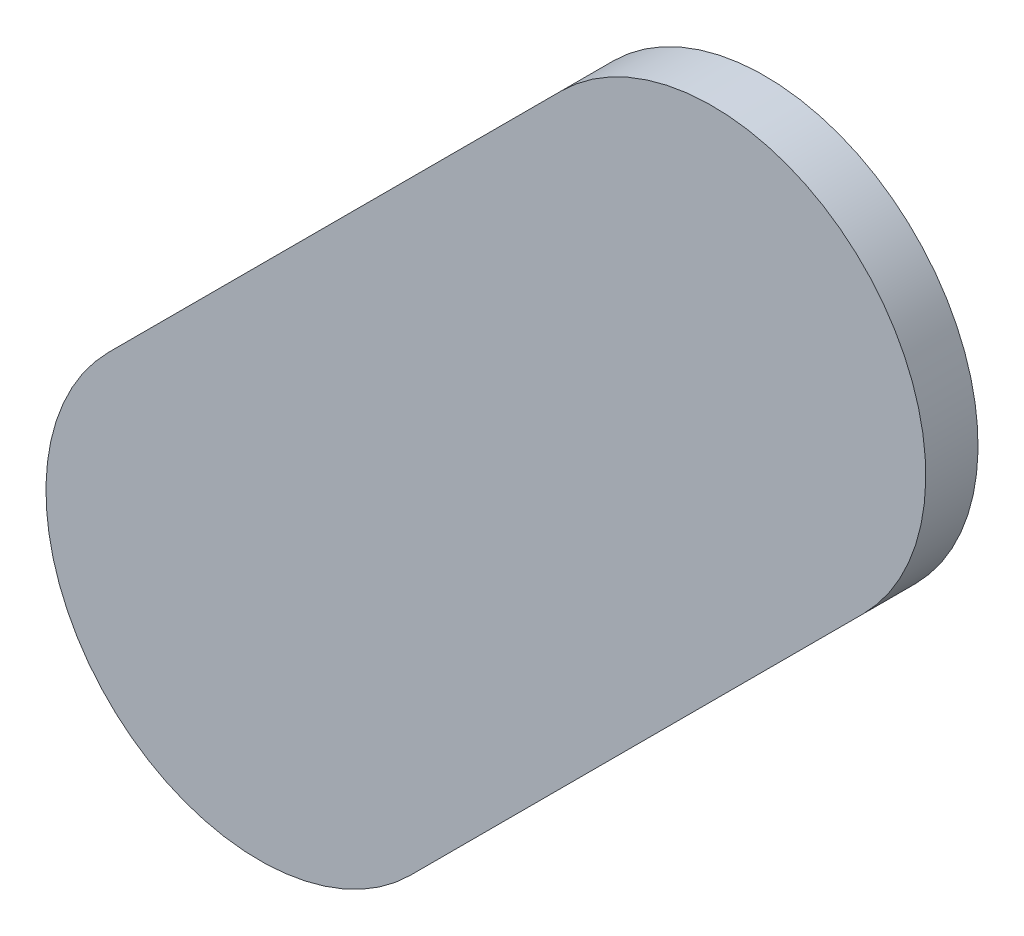
ISO-10303-21;
HEADER;
FILE_DESCRIPTION(('STEP AP214'),'2;1');
FILE_NAME('part.step','',(''),(''),'','','');
FILE_SCHEMA(('AUTOMOTIVE_DESIGN { 1 0 10303 214 1 1 1 1 }'));
ENDSEC;
DATA;
#1=APPLICATION_CONTEXT('core data for automotive mechanical design processes');
#2=APPLICATION_PROTOCOL_DEFINITION('international standard','automotive_design',2000,#1);
#3=PRODUCT_CONTEXT('',#1,'mechanical');
#4=PRODUCT('Part','Part','',(#3));
#5=PRODUCT_RELATED_PRODUCT_CATEGORY('part','',(#4));
#6=PRODUCT_DEFINITION_FORMATION('','',#4);
#7=PRODUCT_DEFINITION_CONTEXT('part definition',#1,'design');
#8=PRODUCT_DEFINITION('design','',#6,#7);
#9=PRODUCT_DEFINITION_SHAPE('','',#8);
#10=(LENGTH_UNIT() NAMED_UNIT(*) SI_UNIT(.MILLI.,.METRE.));
#11=(NAMED_UNIT(*) PLANE_ANGLE_UNIT() SI_UNIT($,.RADIAN.));
#12=(NAMED_UNIT(*) SI_UNIT($,.STERADIAN.) SOLID_ANGLE_UNIT());
#13=UNCERTAINTY_MEASURE_WITH_UNIT(LENGTH_MEASURE(1.E-05),#10,'distance_accuracy_value','');
#14=(GEOMETRIC_REPRESENTATION_CONTEXT(3) GLOBAL_UNCERTAINTY_ASSIGNED_CONTEXT((#13)) GLOBAL_UNIT_ASSIGNED_CONTEXT((#10,
#11,#12)) REPRESENTATION_CONTEXT('',''));
#15=CARTESIAN_POINT('',(0.,0.,0.));
#16=DIRECTION('',(0.,0.,1.));
#17=DIRECTION('',(1.,0.,0.));
#18=AXIS2_PLACEMENT_3D('',#15,#16,#17);
#19=CARTESIAN_POINT('',(3.372482089748,3.506035311465,0.79916));
#20=DIRECTION('',(0.,0.,1.));
#21=DIRECTION('',(1.,0.,0.));
#22=AXIS2_PLACEMENT_3D('',#19,#20,#21);
#23=PLANE('',#22);
#24=CARTESIAN_POINT('',(3.223989333,3.357542667,0.79916));
#25=DIRECTION('',(0.,0.,1.));
#26=DIRECTION('',(1.,0.,0.));
#27=AXIS2_PLACEMENT_3D('',#24,#25,#26);
#28=CIRCLE('',#27,0.139999666);
#29=CARTESIAN_POINT('',(3.32298465012215,3.25854798312204,0.79916));
#30=VERTEX_POINT('',#29);
#31=CARTESIAN_POINT('',(3.12499473875643,3.45653749914002,0.79916));
#32=VERTEX_POINT('',#31);
#33=EDGE_CURVE('E20',#30,#32,#28,.F.);
#34=ORIENTED_EDGE('',*,*,#33,.F.);
#35=DIRECTION('',(-0.707106660628037,-0.707106901745037,0.));
#36=VECTOR('',#35,1.);
#37=CARTESIAN_POINT('',(3.619969282866,3.555532717135,0.79916));
#38=LINE('',#37,#36);
#39=CARTESIAN_POINT('',(3.61996945805482,3.55553289232388,0.79916));
#40=VERTEX_POINT('',#39);
#41=EDGE_CURVE('E65',#30,#40,#38,.F.);
#42=ORIENTED_EDGE('',*,*,#41,.T.);
#43=CARTESIAN_POINT('',(3.520974333,3.654527768268,0.79916));
#44=DIRECTION('',(0.,0.,1.));
#45=DIRECTION('',(1.,0.,0.));
#46=AXIS2_PLACEMENT_3D('',#43,#44,#45);
#47=CIRCLE('',#46,0.14);
#48=CARTESIAN_POINT('',(3.4219793105155,3.75352264451572,0.79916));
#49=VERTEX_POINT('',#48);
#50=EDGE_CURVE('E57',#49,#40,#47,.F.);
#51=ORIENTED_EDGE('',*,*,#50,.F.);
#52=DIRECTION('',(0.707106098309218,0.707107464063218,0.));
#53=VECTOR('',#52,1.);
#54=CARTESIAN_POINT('',(3.124994953307,3.456537713691,0.79916));
#55=LINE('',#54,#53);
#56=EDGE_CURVE('E64',#49,#32,#55,.F.);
#57=ORIENTED_EDGE('',*,*,#56,.T.);
#58=EDGE_LOOP('',(#34,#42,#51,#57));
#59=FACE_BOUND('',#58,.T.);
#60=ADVANCED_FACE('F17',(#59),#23,.T.);
#61=CARTESIAN_POINT('',(3.619969282866,3.555532717135,0.76487));
#62=DIRECTION('',(-0.707106901745037,0.707106660628037,0.));
#63=DIRECTION('',(-0.707106660628037,-0.707106901745037,0.));
#64=AXIS2_PLACEMENT_3D('',#61,#62,#63);
#65=PLANE('',#64);
#66=DIRECTION('',(0.,0.,1.));
#67=VECTOR('',#66,1.);
#68=CARTESIAN_POINT('',(3.3229846670001,3.2585479999999,0.76487));
#69=LINE('',#68,#67);
#70=CARTESIAN_POINT('',(3.32298465012214,3.25854798312203,0.76487));
#71=VERTEX_POINT('',#70);
#72=EDGE_CURVE('E68',#71,#30,#69,.T.);
#73=ORIENTED_EDGE('',*,*,#72,.F.);
#74=DIRECTION('',(-0.70710666062813,-0.707106901744945,0.));
#75=VECTOR('',#74,1.);
#76=CARTESIAN_POINT('',(3.619969282866,3.555532717135,0.76487));
#77=LINE('',#76,#75);
#78=CARTESIAN_POINT('',(3.61996945805481,3.55553289232387,0.76487));
#79=VERTEX_POINT('',#78);
#80=EDGE_CURVE('E72',#79,#71,#77,.T.);
#81=ORIENTED_EDGE('',*,*,#80,.F.);
#82=DIRECTION('',(0.,0.,1.));
#83=VECTOR('',#82,1.);
#84=CARTESIAN_POINT('',(3.619969282866,3.555532717135,0.76487));
#85=LINE('',#84,#83);
#86=EDGE_CURVE('E60',#40,#79,#85,.F.);
#87=ORIENTED_EDGE('',*,*,#86,.F.);
#88=ORIENTED_EDGE('',*,*,#41,.F.);
#89=EDGE_LOOP('',(#73,#81,#87,#88));
#90=FACE_BOUND('',#89,.T.);
#91=ADVANCED_FACE('F70',(#90),#65,.F.);
#92=CARTESIAN_POINT('',(3.223989333,3.357542667,0.76487));
#93=DIRECTION('',(0.,0.,1.));
#94=DIRECTION('',(1.,0.,0.));
#95=AXIS2_PLACEMENT_3D('',#92,#93,#94);
#96=CYLINDRICAL_SURFACE('',#95,0.139999666);
#97=DIRECTION('',(0.,0.,1.));
#98=VECTOR('',#97,1.);
#99=CARTESIAN_POINT('',(3.124994953307,3.456537713691,0.76487));
#100=LINE('',#99,#98);
#101=CARTESIAN_POINT('',(3.12499473875646,3.45653749914004,0.76487));
#102=VERTEX_POINT('',#101);
#103=EDGE_CURVE('E77',#32,#102,#100,.F.);
#104=ORIENTED_EDGE('',*,*,#103,.T.);
#105=CARTESIAN_POINT('',(3.223989667,3.357542898732,0.76487));
#106=DIRECTION('',(0.,0.,1.));
#107=DIRECTION('',(1.,0.,0.));
#108=AXIS2_PLACEMENT_3D('',#105,#106,#107);
#109=CIRCLE('',#108,0.14);
#110=EDGE_CURVE('E26',#71,#102,#109,.F.);
#111=ORIENTED_EDGE('',*,*,#110,.F.);
#112=ORIENTED_EDGE('',*,*,#72,.T.);
#113=ORIENTED_EDGE('',*,*,#33,.T.);
#114=EDGE_LOOP('',(#104,#111,#112,#113));
#115=FACE_BOUND('',#114,.T.);
#116=ADVANCED_FACE('F88',(#115),#96,.T.);
#117=CARTESIAN_POINT('',(3.124994953307,3.456537713691,0.76487));
#118=DIRECTION('',(0.707107464063218,-0.707106098309218,0.));
#119=DIRECTION('',(0.707106098309218,0.707107464063218,0.));
#120=AXIS2_PLACEMENT_3D('',#117,#118,#119);
#121=PLANE('',#120);
#122=DIRECTION('',(0.,0.,1.));
#123=VECTOR('',#122,1.);
#124=CARTESIAN_POINT('',(3.4219793329999,3.7535226670001,0.76487));
#125=LINE('',#124,#123);
#126=CARTESIAN_POINT('',(3.42197931051563,3.75352264451564,0.76487));
#127=VERTEX_POINT('',#126);
#128=EDGE_CURVE('E62',#127,#49,#125,.T.);
#129=ORIENTED_EDGE('',*,*,#128,.F.);
#130=DIRECTION('',(0.707106098309609,0.707107464062826,0.));
#131=VECTOR('',#130,1.);
#132=CARTESIAN_POINT('',(3.124994953307,3.456537713691,0.76487));
#133=LINE('',#132,#131);
#134=EDGE_CURVE('E11',#102,#127,#133,.T.);
#135=ORIENTED_EDGE('',*,*,#134,.F.);
#136=ORIENTED_EDGE('',*,*,#103,.F.);
#137=ORIENTED_EDGE('',*,*,#56,.F.);
#138=EDGE_LOOP('',(#129,#135,#136,#137));
#139=FACE_BOUND('',#138,.T.);
#140=ADVANCED_FACE('F96',(#139),#121,.F.);
#141=CARTESIAN_POINT('',(3.520974333,3.654527768268,0.76487));
#142=DIRECTION('',(0.,0.,1.));
#143=DIRECTION('',(1.,0.,0.));
#144=AXIS2_PLACEMENT_3D('',#141,#142,#143);
#145=CYLINDRICAL_SURFACE('',#144,0.14);
#146=CARTESIAN_POINT('',(3.520974667,3.654528,0.76487));
#147=DIRECTION('',(0.,0.,1.));
#148=DIRECTION('',(1.,0.,0.));
#149=AXIS2_PLACEMENT_3D('',#146,#147,#148);
#150=CIRCLE('',#149,0.14);
#151=EDGE_CURVE('E35',#127,#79,#150,.F.);
#152=ORIENTED_EDGE('',*,*,#151,.F.);
#153=ORIENTED_EDGE('',*,*,#128,.T.);
#154=ORIENTED_EDGE('',*,*,#50,.T.);
#155=ORIENTED_EDGE('',*,*,#86,.T.);
#156=EDGE_LOOP('',(#152,#153,#154,#155));
#157=FACE_BOUND('',#156,.T.);
#158=ADVANCED_FACE('F58',(#157),#145,.T.);
#159=CARTESIAN_POINT('',(3.372482089748,3.506035311465,0.76487));
#160=DIRECTION('',(0.,0.,-1.));
#161=DIRECTION('',(-1.,0.,0.));
#162=AXIS2_PLACEMENT_3D('',#159,#160,#161);
#163=PLANE('',#162);
#164=ORIENTED_EDGE('',*,*,#134,.T.);
#165=ORIENTED_EDGE('',*,*,#151,.T.);
#166=ORIENTED_EDGE('',*,*,#80,.T.);
#167=ORIENTED_EDGE('',*,*,#110,.T.);
#168=EDGE_LOOP('',(#164,#165,#166,#167));
#169=FACE_BOUND('',#168,.T.);
#170=ADVANCED_FACE('F89',(#169),#163,.T.);
#171=CLOSED_SHELL('',(#60,#91,#116,#140,#158,#170));
#172=MANIFOLD_SOLID_BREP('B1',#171);
#173=ADVANCED_BREP_SHAPE_REPRESENTATION('',(#18,#172),#14);
#174=SHAPE_DEFINITION_REPRESENTATION(#9,#173);
ENDSEC;
END-ISO-10303-21;
